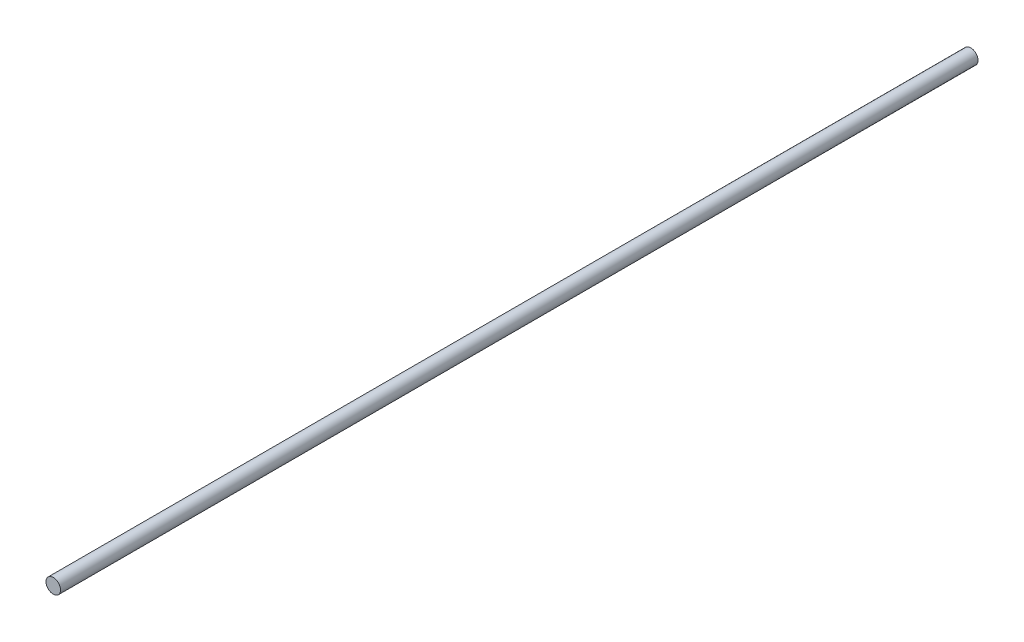
ISO-10303-21;
HEADER;
FILE_DESCRIPTION(('STEP AP214'),'2;1');
FILE_NAME('part.step','',(''),(''),'','','');
FILE_SCHEMA(('AUTOMOTIVE_DESIGN { 1 0 10303 214 1 1 1 1 }'));
ENDSEC;
DATA;
#1=APPLICATION_CONTEXT('core data for automotive mechanical design processes');
#2=APPLICATION_PROTOCOL_DEFINITION('international standard','automotive_design',2000,#1);
#3=PRODUCT_CONTEXT('',#1,'mechanical');
#4=PRODUCT('Part','Part','',(#3));
#5=PRODUCT_RELATED_PRODUCT_CATEGORY('part','',(#4));
#6=PRODUCT_DEFINITION_FORMATION('','',#4);
#7=PRODUCT_DEFINITION_CONTEXT('part definition',#1,'design');
#8=PRODUCT_DEFINITION('design','',#6,#7);
#9=PRODUCT_DEFINITION_SHAPE('','',#8);
#10=(LENGTH_UNIT() NAMED_UNIT(*) SI_UNIT(.MILLI.,.METRE.));
#11=(NAMED_UNIT(*) PLANE_ANGLE_UNIT() SI_UNIT($,.RADIAN.));
#12=(NAMED_UNIT(*) SI_UNIT($,.STERADIAN.) SOLID_ANGLE_UNIT());
#13=UNCERTAINTY_MEASURE_WITH_UNIT(LENGTH_MEASURE(1.E-05),#10,'distance_accuracy_value','');
#14=(GEOMETRIC_REPRESENTATION_CONTEXT(3) GLOBAL_UNCERTAINTY_ASSIGNED_CONTEXT((#13)) GLOBAL_UNIT_ASSIGNED_CONTEXT((#10,
#11,#12)) REPRESENTATION_CONTEXT('',''));
#15=CARTESIAN_POINT('',(0.,0.,0.));
#16=DIRECTION('',(0.,0.,1.));
#17=DIRECTION('',(1.,0.,0.));
#18=AXIS2_PLACEMENT_3D('',#15,#16,#17);
#19=CARTESIAN_POINT('',(0.,0.,400.));
#20=DIRECTION('',(0.,0.,-1.));
#21=DIRECTION('',(-1.,0.,0.));
#22=AXIS2_PLACEMENT_3D('',#19,#20,#21);
#23=CYLINDRICAL_SURFACE('',#22,3.175);
#24=CARTESIAN_POINT('',(0.,0.,400.));
#25=DIRECTION('',(0.,0.,1.));
#26=DIRECTION('',(1.,0.,0.));
#27=AXIS2_PLACEMENT_3D('',#24,#25,#26);
#28=CIRCLE('',#27,3.175);
#29=CARTESIAN_POINT('',(3.175,0.,400.));
#30=VERTEX_POINT('',#29);
#31=EDGE_CURVE('E10',#30,#30,#28,.T.);
#32=ORIENTED_EDGE('',*,*,#31,.F.);
#33=EDGE_LOOP('',(#32));
#34=FACE_BOUND('',#33,.T.);
#35=CARTESIAN_POINT('',(0.,0.,0.));
#36=DIRECTION('',(0.,0.,1.));
#37=DIRECTION('',(1.,0.,0.));
#38=AXIS2_PLACEMENT_3D('',#35,#36,#37);
#39=CIRCLE('',#38,3.175);
#40=CARTESIAN_POINT('',(3.175,0.,0.));
#41=VERTEX_POINT('',#40);
#42=EDGE_CURVE('E32',#41,#41,#39,.T.);
#43=ORIENTED_EDGE('',*,*,#42,.T.);
#44=EDGE_LOOP('',(#43));
#45=FACE_BOUND('',#44,.T.);
#46=ADVANCED_FACE('F29',(#34,#45),#23,.T.);
#47=CARTESIAN_POINT('',(0.,0.,400.));
#48=DIRECTION('',(0.,0.,1.));
#49=DIRECTION('',(1.,0.,0.));
#50=AXIS2_PLACEMENT_3D('',#47,#48,#49);
#51=PLANE('',#50);
#52=ORIENTED_EDGE('',*,*,#31,.T.);
#53=EDGE_LOOP('',(#52));
#54=FACE_BOUND('',#53,.T.);
#55=ADVANCED_FACE('F44',(#54),#51,.T.);
#56=CARTESIAN_POINT('',(0.,0.,0.));
#57=DIRECTION('',(0.,0.,1.));
#58=DIRECTION('',(1.,0.,0.));
#59=AXIS2_PLACEMENT_3D('',#56,#57,#58);
#60=PLANE('',#59);
#61=ORIENTED_EDGE('',*,*,#42,.F.);
#62=EDGE_LOOP('',(#61));
#63=FACE_BOUND('',#62,.T.);
#64=ADVANCED_FACE('F42',(#63),#60,.F.);
#65=CLOSED_SHELL('',(#46,#55,#64));
#66=MANIFOLD_SOLID_BREP('B2',#65);
#67=ADVANCED_BREP_SHAPE_REPRESENTATION('',(#18,#66),#14);
#68=SHAPE_DEFINITION_REPRESENTATION(#9,#67);
ENDSEC;
END-ISO-10303-21;
